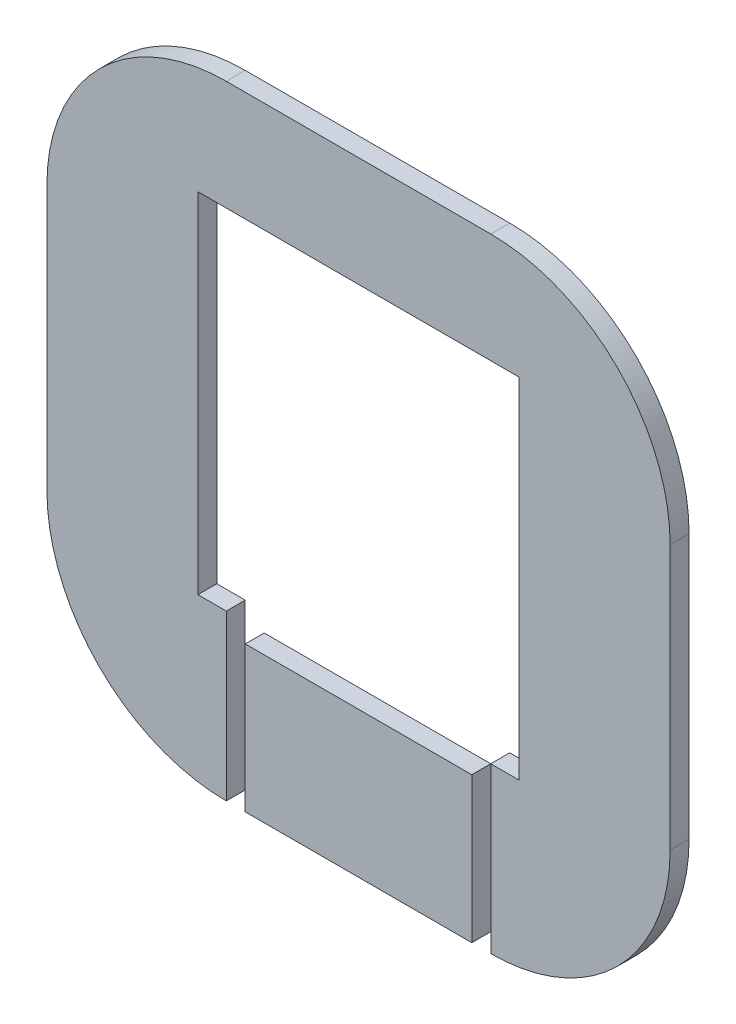
ISO-10303-21;
HEADER;
FILE_DESCRIPTION(('STEP AP214'),'2;1');
FILE_NAME('part.step','',(''),(''),'','','');
FILE_SCHEMA(('AUTOMOTIVE_DESIGN { 1 0 10303 214 1 1 1 1 }'));
ENDSEC;
DATA;
#1=APPLICATION_CONTEXT('core data for automotive mechanical design processes');
#2=APPLICATION_PROTOCOL_DEFINITION('international standard','automotive_design',2000,#1);
#3=PRODUCT_CONTEXT('',#1,'mechanical');
#4=PRODUCT('Part','Part','',(#3));
#5=PRODUCT_RELATED_PRODUCT_CATEGORY('part','',(#4));
#6=PRODUCT_DEFINITION_FORMATION('','',#4);
#7=PRODUCT_DEFINITION_CONTEXT('part definition',#1,'design');
#8=PRODUCT_DEFINITION('design','',#6,#7);
#9=PRODUCT_DEFINITION_SHAPE('','',#8);
#10=(LENGTH_UNIT() NAMED_UNIT(*) SI_UNIT(.MILLI.,.METRE.));
#11=(NAMED_UNIT(*) PLANE_ANGLE_UNIT() SI_UNIT($,.RADIAN.));
#12=(NAMED_UNIT(*) SI_UNIT($,.STERADIAN.) SOLID_ANGLE_UNIT());
#13=UNCERTAINTY_MEASURE_WITH_UNIT(LENGTH_MEASURE(1.E-05),#10,'distance_accuracy_value','');
#14=(GEOMETRIC_REPRESENTATION_CONTEXT(3) GLOBAL_UNCERTAINTY_ASSIGNED_CONTEXT((#13)) GLOBAL_UNIT_ASSIGNED_CONTEXT((#10,
#11,#12)) REPRESENTATION_CONTEXT('',''));
#15=CARTESIAN_POINT('',(0.,0.,0.));
#16=DIRECTION('',(0.,0.,1.));
#17=DIRECTION('',(1.,0.,0.));
#18=AXIS2_PLACEMENT_3D('',#15,#16,#17);
#19=CARTESIAN_POINT('',(30.,-51.5,4.3));
#20=DIRECTION('',(0.,0.,1.));
#21=DIRECTION('',(1.,0.,0.));
#22=AXIS2_PLACEMENT_3D('',#19,#20,#21);
#23=PLANE('',#22);
#24=DIRECTION('',(0.,1.,0.));
#25=VECTOR('',#24,1.);
#26=CARTESIAN_POINT('',(30.,0.,4.3));
#27=LINE('',#26,#25);
#28=CARTESIAN_POINT('',(30.,-92.2,4.3));
#29=VERTEX_POINT('',#28);
#30=CARTESIAN_POINT('',(30.,-54.89,4.3));
#31=VERTEX_POINT('',#30);
#32=EDGE_CURVE('E202',#29,#31,#27,.T.);
#33=ORIENTED_EDGE('',*,*,#32,.F.);
#34=CARTESIAN_POINT('',(30.,-51.5,4.3));
#35=DIRECTION('',(0.,0.,1.));
#36=DIRECTION('',(1.,0.,0.));
#37=AXIS2_PLACEMENT_3D('',#34,#35,#36);
#38=CIRCLE('',#37,40.7);
#39=CARTESIAN_POINT('',(70.7,-51.5,4.3));
#40=VERTEX_POINT('',#39);
#41=EDGE_CURVE('E290',#29,#40,#38,.T.);
#42=ORIENTED_EDGE('',*,*,#41,.T.);
#43=DIRECTION('',(0.,1.,0.));
#44=VECTOR('',#43,1.);
#45=CARTESIAN_POINT('',(70.7,8.50000000000001,4.3));
#46=LINE('',#45,#44);
#47=CARTESIAN_POINT('',(70.7,8.50000000000001,4.3));
#48=VERTEX_POINT('',#47);
#49=EDGE_CURVE('E287',#40,#48,#46,.T.);
#50=ORIENTED_EDGE('',*,*,#49,.T.);
#51=CARTESIAN_POINT('',(30.,8.50000000000001,4.3));
#52=DIRECTION('',(0.,0.,1.));
#53=DIRECTION('',(-1.,0.,0.));
#54=AXIS2_PLACEMENT_3D('',#51,#52,#53);
#55=CIRCLE('',#54,40.7);
#56=CARTESIAN_POINT('',(30.,49.2,4.3));
#57=VERTEX_POINT('',#56);
#58=EDGE_CURVE('E283',#48,#57,#55,.T.);
#59=ORIENTED_EDGE('',*,*,#58,.T.);
#60=DIRECTION('',(-1.,0.,0.));
#61=VECTOR('',#60,1.);
#62=CARTESIAN_POINT('',(-30.,49.2,4.3));
#63=LINE('',#62,#61);
#64=CARTESIAN_POINT('',(-30.,49.2,4.3));
#65=VERTEX_POINT('',#64);
#66=EDGE_CURVE('E279',#57,#65,#63,.T.);
#67=ORIENTED_EDGE('',*,*,#66,.T.);
#68=CARTESIAN_POINT('',(-30.,8.5,4.3));
#69=DIRECTION('',(0.,0.,1.));
#70=DIRECTION('',(-1.,0.,0.));
#71=AXIS2_PLACEMENT_3D('',#68,#69,#70);
#72=CIRCLE('',#71,40.7);
#73=CARTESIAN_POINT('',(-70.7,8.50000000000001,4.3));
#74=VERTEX_POINT('',#73);
#75=EDGE_CURVE('E275',#65,#74,#72,.T.);
#76=ORIENTED_EDGE('',*,*,#75,.T.);
#77=DIRECTION('',(0.,-1.,0.));
#78=VECTOR('',#77,1.);
#79=CARTESIAN_POINT('',(-70.7,8.50000000000001,4.3));
#80=LINE('',#79,#78);
#81=CARTESIAN_POINT('',(-70.7,-51.5,4.3));
#82=VERTEX_POINT('',#81);
#83=EDGE_CURVE('E271',#74,#82,#80,.T.);
#84=ORIENTED_EDGE('',*,*,#83,.T.);
#85=CARTESIAN_POINT('',(-30.,-51.5,4.3));
#86=DIRECTION('',(0.,0.,1.));
#87=DIRECTION('',(1.,0.,0.));
#88=AXIS2_PLACEMENT_3D('',#85,#86,#87);
#89=CIRCLE('',#88,40.7);
#90=CARTESIAN_POINT('',(-30.,-92.2,4.3));
#91=VERTEX_POINT('',#90);
#92=EDGE_CURVE('E214',#82,#91,#89,.T.);
#93=ORIENTED_EDGE('',*,*,#92,.T.);
#94=DIRECTION('',(0.,1.,0.));
#95=VECTOR('',#94,1.);
#96=CARTESIAN_POINT('',(-30.,0.,4.3));
#97=LINE('',#96,#95);
#98=CARTESIAN_POINT('',(-30.,-54.89,4.3));
#99=VERTEX_POINT('',#98);
#100=EDGE_CURVE('E209',#91,#99,#97,.T.);
#101=ORIENTED_EDGE('',*,*,#100,.T.);
#102=DIRECTION('',(1.,0.,0.));
#103=VECTOR('',#102,1.);
#104=CARTESIAN_POINT('',(0.,-54.89,4.3));
#105=LINE('',#104,#103);
#106=CARTESIAN_POINT('',(-36.45,-54.89,4.3));
#107=VERTEX_POINT('',#106);
#108=EDGE_CURVE('E159',#107,#99,#105,.T.);
#109=ORIENTED_EDGE('',*,*,#108,.F.);
#110=DIRECTION('',(0.,-1.,0.));
#111=VECTOR('',#110,1.);
#112=CARTESIAN_POINT('',(-36.45,0.,4.3));
#113=LINE('',#112,#111);
#114=CARTESIAN_POINT('',(-36.45,24.29,4.3));
#115=VERTEX_POINT('',#114);
#116=EDGE_CURVE('E154',#115,#107,#113,.T.);
#117=ORIENTED_EDGE('',*,*,#116,.F.);
#118=DIRECTION('',(1.,0.,0.));
#119=VECTOR('',#118,1.);
#120=CARTESIAN_POINT('',(0.,24.29,4.3));
#121=LINE('',#120,#119);
#122=CARTESIAN_POINT('',(36.45,24.29,4.3));
#123=VERTEX_POINT('',#122);
#124=EDGE_CURVE('E213',#115,#123,#121,.T.);
#125=ORIENTED_EDGE('',*,*,#124,.T.);
#126=DIRECTION('',(0.,-1.,0.));
#127=VECTOR('',#126,1.);
#128=CARTESIAN_POINT('',(36.45,0.,4.3));
#129=LINE('',#128,#127);
#130=CARTESIAN_POINT('',(36.45,-54.89,4.3));
#131=VERTEX_POINT('',#130);
#132=EDGE_CURVE('E220',#123,#131,#129,.T.);
#133=ORIENTED_EDGE('',*,*,#132,.T.);
#134=EDGE_CURVE('E203',#31,#131,#105,.T.);
#135=ORIENTED_EDGE('',*,*,#134,.F.);
#136=EDGE_LOOP('',(#33,#42,#50,#59,#67,#76,#84,#93,#101,#109,#117,#125,#133,#135));
#137=FACE_BOUND('',#136,.T.);
#138=ADVANCED_FACE('F90',(#137),#23,.T.);
#139=CARTESIAN_POINT('',(30.,-51.5,0.));
#140=DIRECTION('',(0.,0.,1.));
#141=DIRECTION('',(1.,0.,0.));
#142=AXIS2_PLACEMENT_3D('',#139,#140,#141);
#143=PLANE('',#142);
#144=CARTESIAN_POINT('',(30.,-51.5,0.));
#145=DIRECTION('',(0.,0.,1.));
#146=DIRECTION('',(1.,0.,0.));
#147=AXIS2_PLACEMENT_3D('',#144,#145,#146);
#148=CIRCLE('',#147,40.7);
#149=CARTESIAN_POINT('',(30.,-92.2,0.));
#150=VERTEX_POINT('',#149);
#151=CARTESIAN_POINT('',(70.7,-51.5,0.));
#152=VERTEX_POINT('',#151);
#153=EDGE_CURVE('E169',#150,#152,#148,.T.);
#154=ORIENTED_EDGE('',*,*,#153,.F.);
#155=DIRECTION('',(0.,1.,0.));
#156=VECTOR('',#155,1.);
#157=CARTESIAN_POINT('',(30.,0.,0.));
#158=LINE('',#157,#156);
#159=CARTESIAN_POINT('',(30.,-54.89,0.));
#160=VERTEX_POINT('',#159);
#161=EDGE_CURVE('E181',#150,#160,#158,.T.);
#162=ORIENTED_EDGE('',*,*,#161,.T.);
#163=DIRECTION('',(1.,0.,0.));
#164=VECTOR('',#163,1.);
#165=CARTESIAN_POINT('',(0.,-54.89,0.));
#166=LINE('',#165,#164);
#167=CARTESIAN_POINT('',(36.45,-54.89,0.));
#168=VERTEX_POINT('',#167);
#169=EDGE_CURVE('E171',#160,#168,#166,.T.);
#170=ORIENTED_EDGE('',*,*,#169,.T.);
#171=DIRECTION('',(0.,-1.,0.));
#172=VECTOR('',#171,1.);
#173=CARTESIAN_POINT('',(36.45,0.,0.));
#174=LINE('',#173,#172);
#175=CARTESIAN_POINT('',(36.45,24.29,0.));
#176=VERTEX_POINT('',#175);
#177=EDGE_CURVE('E93',#176,#168,#174,.T.);
#178=ORIENTED_EDGE('',*,*,#177,.F.);
#179=DIRECTION('',(1.,0.,0.));
#180=VECTOR('',#179,1.);
#181=CARTESIAN_POINT('',(0.,24.29,0.));
#182=LINE('',#181,#180);
#183=CARTESIAN_POINT('',(-36.45,24.29,0.));
#184=VERTEX_POINT('',#183);
#185=EDGE_CURVE('E176',#184,#176,#182,.T.);
#186=ORIENTED_EDGE('',*,*,#185,.F.);
#187=DIRECTION('',(0.,-1.,0.));
#188=VECTOR('',#187,1.);
#189=CARTESIAN_POINT('',(-36.45,0.,0.));
#190=LINE('',#189,#188);
#191=CARTESIAN_POINT('',(-36.45,-54.89,0.));
#192=VERTEX_POINT('',#191);
#193=EDGE_CURVE('E151',#184,#192,#190,.T.);
#194=ORIENTED_EDGE('',*,*,#193,.T.);
#195=CARTESIAN_POINT('',(-30.,-54.89,0.));
#196=VERTEX_POINT('',#195);
#197=EDGE_CURVE('E163',#192,#196,#166,.T.);
#198=ORIENTED_EDGE('',*,*,#197,.T.);
#199=DIRECTION('',(0.,1.,0.));
#200=VECTOR('',#199,1.);
#201=CARTESIAN_POINT('',(-30.,0.,0.));
#202=LINE('',#201,#200);
#203=CARTESIAN_POINT('',(-30.,-92.2,0.));
#204=VERTEX_POINT('',#203);
#205=EDGE_CURVE('E199',#204,#196,#202,.T.);
#206=ORIENTED_EDGE('',*,*,#205,.F.);
#207=CARTESIAN_POINT('',(-30.,-51.5,0.));
#208=DIRECTION('',(0.,0.,1.));
#209=DIRECTION('',(1.,0.,0.));
#210=AXIS2_PLACEMENT_3D('',#207,#208,#209);
#211=CIRCLE('',#210,40.7);
#212=CARTESIAN_POINT('',(-70.7,-51.5,0.));
#213=VERTEX_POINT('',#212);
#214=EDGE_CURVE('E235',#213,#204,#211,.T.);
#215=ORIENTED_EDGE('',*,*,#214,.F.);
#216=DIRECTION('',(0.,-1.,0.));
#217=VECTOR('',#216,1.);
#218=CARTESIAN_POINT('',(-70.7,8.50000000000001,0.));
#219=LINE('',#218,#217);
#220=CARTESIAN_POINT('',(-70.7,8.50000000000001,0.));
#221=VERTEX_POINT('',#220);
#222=EDGE_CURVE('E240',#221,#213,#219,.T.);
#223=ORIENTED_EDGE('',*,*,#222,.F.);
#224=CARTESIAN_POINT('',(-30.,8.5,0.));
#225=DIRECTION('',(0.,0.,1.));
#226=DIRECTION('',(-1.,0.,0.));
#227=AXIS2_PLACEMENT_3D('',#224,#225,#226);
#228=CIRCLE('',#227,40.7);
#229=CARTESIAN_POINT('',(-30.,49.2,0.));
#230=VERTEX_POINT('',#229);
#231=EDGE_CURVE('E245',#230,#221,#228,.T.);
#232=ORIENTED_EDGE('',*,*,#231,.F.);
#233=DIRECTION('',(-1.,0.,0.));
#234=VECTOR('',#233,1.);
#235=CARTESIAN_POINT('',(-30.,49.2,0.));
#236=LINE('',#235,#234);
#237=CARTESIAN_POINT('',(30.,49.2,0.));
#238=VERTEX_POINT('',#237);
#239=EDGE_CURVE('E250',#238,#230,#236,.T.);
#240=ORIENTED_EDGE('',*,*,#239,.F.);
#241=CARTESIAN_POINT('',(30.,8.50000000000001,0.));
#242=DIRECTION('',(0.,0.,1.));
#243=DIRECTION('',(-1.,0.,0.));
#244=AXIS2_PLACEMENT_3D('',#241,#242,#243);
#245=CIRCLE('',#244,40.7);
#246=CARTESIAN_POINT('',(70.7,8.50000000000001,0.));
#247=VERTEX_POINT('',#246);
#248=EDGE_CURVE('E255',#247,#238,#245,.T.);
#249=ORIENTED_EDGE('',*,*,#248,.F.);
#250=DIRECTION('',(0.,1.,0.));
#251=VECTOR('',#250,1.);
#252=CARTESIAN_POINT('',(70.7,8.50000000000001,0.));
#253=LINE('',#252,#251);
#254=EDGE_CURVE('E260',#152,#247,#253,.T.);
#255=ORIENTED_EDGE('',*,*,#254,.F.);
#256=EDGE_LOOP('',(#154,#162,#170,#178,#186,#194,#198,#206,#215,#223,#232,#240,#249,#255));
#257=FACE_BOUND('',#256,.T.);
#258=ADVANCED_FACE('F173',(#257),#143,.F.);
#259=CARTESIAN_POINT('',(30.,-51.5,4.3));
#260=DIRECTION('',(0.,0.,-1.));
#261=DIRECTION('',(-1.,0.,0.));
#262=AXIS2_PLACEMENT_3D('',#259,#260,#261);
#263=CYLINDRICAL_SURFACE('',#262,40.7);
#264=ORIENTED_EDGE('',*,*,#153,.T.);
#265=DIRECTION('',(0.,0.,-1.));
#266=VECTOR('',#265,1.);
#267=CARTESIAN_POINT('',(70.7,-51.5,4.3));
#268=LINE('',#267,#266);
#269=EDGE_CURVE('E259',#40,#152,#268,.T.);
#270=ORIENTED_EDGE('',*,*,#269,.F.);
#271=ORIENTED_EDGE('',*,*,#41,.F.);
#272=DIRECTION('',(0.,0.,-1.));
#273=VECTOR('',#272,1.);
#274=CARTESIAN_POINT('',(30.,-92.2,4.3));
#275=LINE('',#274,#273);
#276=EDGE_CURVE('E264',#29,#150,#275,.T.);
#277=ORIENTED_EDGE('',*,*,#276,.T.);
#278=EDGE_LOOP('',(#264,#270,#271,#277));
#279=FACE_BOUND('',#278,.T.);
#280=ADVANCED_FACE('F306',(#279),#263,.T.);
#281=CARTESIAN_POINT('',(70.7,8.50000000000001,4.3));
#282=DIRECTION('',(-1.,0.,0.));
#283=DIRECTION('',(0.,-1.,0.));
#284=AXIS2_PLACEMENT_3D('',#281,#282,#283);
#285=PLANE('',#284);
#286=ORIENTED_EDGE('',*,*,#254,.T.);
#287=DIRECTION('',(0.,0.,-1.));
#288=VECTOR('',#287,1.);
#289=CARTESIAN_POINT('',(70.7,8.50000000000001,4.3));
#290=LINE('',#289,#288);
#291=EDGE_CURVE('E254',#48,#247,#290,.T.);
#292=ORIENTED_EDGE('',*,*,#291,.F.);
#293=ORIENTED_EDGE('',*,*,#49,.F.);
#294=ORIENTED_EDGE('',*,*,#269,.T.);
#295=EDGE_LOOP('',(#286,#292,#293,#294));
#296=FACE_BOUND('',#295,.T.);
#297=ADVANCED_FACE('F312',(#296),#285,.F.);
#298=CARTESIAN_POINT('',(30.,8.50000000000001,4.3));
#299=DIRECTION('',(0.,0.,-1.));
#300=DIRECTION('',(-1.,0.,0.));
#301=AXIS2_PLACEMENT_3D('',#298,#299,#300);
#302=CYLINDRICAL_SURFACE('',#301,40.7);
#303=ORIENTED_EDGE('',*,*,#248,.T.);
#304=DIRECTION('',(0.,0.,-1.));
#305=VECTOR('',#304,1.);
#306=CARTESIAN_POINT('',(30.,49.2,4.3));
#307=LINE('',#306,#305);
#308=EDGE_CURVE('E249',#57,#238,#307,.T.);
#309=ORIENTED_EDGE('',*,*,#308,.F.);
#310=ORIENTED_EDGE('',*,*,#58,.F.);
#311=ORIENTED_EDGE('',*,*,#291,.T.);
#312=EDGE_LOOP('',(#303,#309,#310,#311));
#313=FACE_BOUND('',#312,.T.);
#314=ADVANCED_FACE('F323',(#313),#302,.T.);
#315=CARTESIAN_POINT('',(-30.,49.2,4.3));
#316=DIRECTION('',(0.,-1.,0.));
#317=DIRECTION('',(1.,0.,0.));
#318=AXIS2_PLACEMENT_3D('',#315,#316,#317);
#319=PLANE('',#318);
#320=ORIENTED_EDGE('',*,*,#239,.T.);
#321=DIRECTION('',(0.,0.,-1.));
#322=VECTOR('',#321,1.);
#323=CARTESIAN_POINT('',(-30.,49.2,4.3));
#324=LINE('',#323,#322);
#325=EDGE_CURVE('E244',#65,#230,#324,.T.);
#326=ORIENTED_EDGE('',*,*,#325,.F.);
#327=ORIENTED_EDGE('',*,*,#66,.F.);
#328=ORIENTED_EDGE('',*,*,#308,.T.);
#329=EDGE_LOOP('',(#320,#326,#327,#328));
#330=FACE_BOUND('',#329,.T.);
#331=ADVANCED_FACE('F408',(#330),#319,.F.);
#332=CARTESIAN_POINT('',(-30.,8.5,4.3));
#333=DIRECTION('',(0.,0.,-1.));
#334=DIRECTION('',(-1.,0.,0.));
#335=AXIS2_PLACEMENT_3D('',#332,#333,#334);
#336=CYLINDRICAL_SURFACE('',#335,40.7);
#337=ORIENTED_EDGE('',*,*,#231,.T.);
#338=DIRECTION('',(0.,0.,-1.));
#339=VECTOR('',#338,1.);
#340=CARTESIAN_POINT('',(-70.7,8.50000000000001,4.3));
#341=LINE('',#340,#339);
#342=EDGE_CURVE('E239',#74,#221,#341,.T.);
#343=ORIENTED_EDGE('',*,*,#342,.F.);
#344=ORIENTED_EDGE('',*,*,#75,.F.);
#345=ORIENTED_EDGE('',*,*,#325,.T.);
#346=EDGE_LOOP('',(#337,#343,#344,#345));
#347=FACE_BOUND('',#346,.T.);
#348=ADVANCED_FACE('F353',(#347),#336,.T.);
#349=CARTESIAN_POINT('',(-70.7,8.50000000000001,4.3));
#350=DIRECTION('',(1.,0.,0.));
#351=DIRECTION('',(0.,0.,-1.));
#352=AXIS2_PLACEMENT_3D('',#349,#350,#351);
#353=PLANE('',#352);
#354=ORIENTED_EDGE('',*,*,#222,.T.);
#355=DIRECTION('',(0.,0.,-1.));
#356=VECTOR('',#355,1.);
#357=CARTESIAN_POINT('',(-70.7,-51.5,4.3));
#358=LINE('',#357,#356);
#359=EDGE_CURVE('E233',#82,#213,#358,.T.);
#360=ORIENTED_EDGE('',*,*,#359,.F.);
#361=ORIENTED_EDGE('',*,*,#83,.F.);
#362=ORIENTED_EDGE('',*,*,#342,.T.);
#363=EDGE_LOOP('',(#354,#360,#361,#362));
#364=FACE_BOUND('',#363,.T.);
#365=ADVANCED_FACE('F359',(#364),#353,.F.);
#366=CARTESIAN_POINT('',(-30.,-51.5,4.3));
#367=DIRECTION('',(0.,0.,-1.));
#368=DIRECTION('',(-1.,0.,0.));
#369=AXIS2_PLACEMENT_3D('',#366,#367,#368);
#370=CYLINDRICAL_SURFACE('',#369,40.7);
#371=ORIENTED_EDGE('',*,*,#214,.T.);
#372=DIRECTION('',(0.,0.,-1.));
#373=VECTOR('',#372,1.);
#374=CARTESIAN_POINT('',(-30.,-92.2,4.3));
#375=LINE('',#374,#373);
#376=EDGE_CURVE('E208',#91,#204,#375,.T.);
#377=ORIENTED_EDGE('',*,*,#376,.F.);
#378=ORIENTED_EDGE('',*,*,#92,.F.);
#379=ORIENTED_EDGE('',*,*,#359,.T.);
#380=EDGE_LOOP('',(#371,#377,#378,#379));
#381=FACE_BOUND('',#380,.T.);
#382=ADVANCED_FACE('F365',(#381),#370,.T.);
#383=CARTESIAN_POINT('',(0.,-54.89,0.));
#384=DIRECTION('',(0.,-1.,0.));
#385=DIRECTION('',(0.,0.,-1.));
#386=AXIS2_PLACEMENT_3D('',#383,#384,#385);
#387=PLANE('',#386);
#388=ORIENTED_EDGE('',*,*,#134,.T.);
#389=DIRECTION('',(0.,0.,1.));
#390=VECTOR('',#389,1.);
#391=CARTESIAN_POINT('',(36.45,-54.89,0.));
#392=LINE('',#391,#390);
#393=EDGE_CURVE('E13',#168,#131,#392,.T.);
#394=ORIENTED_EDGE('',*,*,#393,.F.);
#395=ORIENTED_EDGE('',*,*,#169,.F.);
#396=DIRECTION('',(0.,0.,1.));
#397=VECTOR('',#396,1.);
#398=CARTESIAN_POINT('',(30.,-54.89,0.));
#399=LINE('',#398,#397);
#400=EDGE_CURVE('E200',#160,#31,#399,.T.);
#401=ORIENTED_EDGE('',*,*,#400,.T.);
#402=EDGE_LOOP('',(#388,#394,#395,#401));
#403=FACE_BOUND('',#402,.T.);
#404=ADVANCED_FACE('F374',(#403),#387,.F.);
#405=CARTESIAN_POINT('',(30.,0.,0.));
#406=DIRECTION('',(1.,0.,0.));
#407=DIRECTION('',(0.,0.,-1.));
#408=AXIS2_PLACEMENT_3D('',#405,#406,#407);
#409=PLANE('',#408);
#410=ORIENTED_EDGE('',*,*,#32,.T.);
#411=ORIENTED_EDGE('',*,*,#400,.F.);
#412=ORIENTED_EDGE('',*,*,#161,.F.);
#413=ORIENTED_EDGE('',*,*,#276,.F.);
#414=EDGE_LOOP('',(#410,#411,#412,#413));
#415=FACE_BOUND('',#414,.T.);
#416=ADVANCED_FACE('F335',(#415),#409,.F.);
#417=CARTESIAN_POINT('',(-30.,0.,0.));
#418=DIRECTION('',(1.,0.,0.));
#419=DIRECTION('',(0.,0.,-1.));
#420=AXIS2_PLACEMENT_3D('',#417,#418,#419);
#421=PLANE('',#420);
#422=ORIENTED_EDGE('',*,*,#100,.F.);
#423=ORIENTED_EDGE('',*,*,#376,.T.);
#424=ORIENTED_EDGE('',*,*,#205,.T.);
#425=DIRECTION('',(0.,0.,1.));
#426=VECTOR('',#425,1.);
#427=CARTESIAN_POINT('',(-30.,-54.89,0.));
#428=LINE('',#427,#426);
#429=EDGE_CURVE('E165',#196,#99,#428,.T.);
#430=ORIENTED_EDGE('',*,*,#429,.T.);
#431=EDGE_LOOP('',(#422,#423,#424,#430));
#432=FACE_BOUND('',#431,.T.);
#433=ADVANCED_FACE('F366',(#432),#421,.T.);
#434=ORIENTED_EDGE('',*,*,#108,.T.);
#435=ORIENTED_EDGE('',*,*,#429,.F.);
#436=ORIENTED_EDGE('',*,*,#197,.F.);
#437=DIRECTION('',(0.,0.,1.));
#438=VECTOR('',#437,1.);
#439=CARTESIAN_POINT('',(-36.45,-54.89,0.));
#440=LINE('',#439,#438);
#441=EDGE_CURVE('E147',#192,#107,#440,.T.);
#442=ORIENTED_EDGE('',*,*,#441,.T.);
#443=EDGE_LOOP('',(#434,#435,#436,#442));
#444=FACE_BOUND('',#443,.T.);
#445=ADVANCED_FACE('F164',(#444),#387,.F.);
#446=CARTESIAN_POINT('',(-36.45,0.,0.));
#447=DIRECTION('',(-1.,0.,0.));
#448=DIRECTION('',(0.,-1.,0.));
#449=AXIS2_PLACEMENT_3D('',#446,#447,#448);
#450=PLANE('',#449);
#451=ORIENTED_EDGE('',*,*,#116,.T.);
#452=ORIENTED_EDGE('',*,*,#441,.F.);
#453=ORIENTED_EDGE('',*,*,#193,.F.);
#454=DIRECTION('',(0.,0.,1.));
#455=VECTOR('',#454,1.);
#456=CARTESIAN_POINT('',(-36.45,24.29,0.));
#457=LINE('',#456,#455);
#458=EDGE_CURVE('E185',#184,#115,#457,.T.);
#459=ORIENTED_EDGE('',*,*,#458,.T.);
#460=EDGE_LOOP('',(#451,#452,#453,#459));
#461=FACE_BOUND('',#460,.T.);
#462=ADVANCED_FACE('F149',(#461),#450,.F.);
#463=CARTESIAN_POINT('',(0.,24.29,0.));
#464=DIRECTION('',(0.,-1.,0.));
#465=DIRECTION('',(0.,0.,-1.));
#466=AXIS2_PLACEMENT_3D('',#463,#464,#465);
#467=PLANE('',#466);
#468=ORIENTED_EDGE('',*,*,#124,.F.);
#469=ORIENTED_EDGE('',*,*,#458,.F.);
#470=ORIENTED_EDGE('',*,*,#185,.T.);
#471=DIRECTION('',(0.,0.,1.));
#472=VECTOR('',#471,1.);
#473=CARTESIAN_POINT('',(36.45,24.29,0.));
#474=LINE('',#473,#472);
#475=EDGE_CURVE('E184',#176,#123,#474,.T.);
#476=ORIENTED_EDGE('',*,*,#475,.T.);
#477=EDGE_LOOP('',(#468,#469,#470,#476));
#478=FACE_BOUND('',#477,.T.);
#479=ADVANCED_FACE('F395',(#478),#467,.T.);
#480=CARTESIAN_POINT('',(36.45,0.,0.));
#481=DIRECTION('',(-1.,0.,0.));
#482=DIRECTION('',(0.,-1.,0.));
#483=AXIS2_PLACEMENT_3D('',#480,#481,#482);
#484=PLANE('',#483);
#485=ORIENTED_EDGE('',*,*,#132,.F.);
#486=ORIENTED_EDGE('',*,*,#475,.F.);
#487=ORIENTED_EDGE('',*,*,#177,.T.);
#488=ORIENTED_EDGE('',*,*,#393,.T.);
#489=EDGE_LOOP('',(#485,#486,#487,#488));
#490=FACE_BOUND('',#489,.T.);
#491=ADVANCED_FACE('F393',(#490),#484,.T.);
#492=CLOSED_SHELL('',(#138,#258,#280,#297,#314,#331,#348,#365,#382,#404,#416,#433,#445,#462,
#479,#491));
#493=MANIFOLD_SOLID_BREP('B2',#492);
#494=CARTESIAN_POINT('',(30.,-51.5,0.));
#495=DIRECTION('',(0.,0.,1.));
#496=DIRECTION('',(1.,0.,0.));
#497=AXIS2_PLACEMENT_3D('',#494,#495,#496);
#498=PLANE('',#497);
#499=DIRECTION('',(1.,0.,0.));
#500=VECTOR('',#499,1.);
#501=CARTESIAN_POINT('',(0.500000000000032,-92.2,0.));
#502=LINE('',#501,#500);
#503=CARTESIAN_POINT('',(-25.7,-92.2,0.));
#504=VERTEX_POINT('',#503);
#505=CARTESIAN_POINT('',(25.7,-92.2,0.));
#506=VERTEX_POINT('',#505);
#507=EDGE_CURVE('E528',#504,#506,#502,.T.);
#508=ORIENTED_EDGE('',*,*,#507,.F.);
#509=DIRECTION('',(0.,1.,0.));
#510=VECTOR('',#509,1.);
#511=CARTESIAN_POINT('',(-25.7,0.,0.));
#512=LINE('',#511,#510);
#513=CARTESIAN_POINT('',(-25.7,-59.19,0.));
#514=VERTEX_POINT('',#513);
#515=EDGE_CURVE('E571',#504,#514,#512,.T.);
#516=ORIENTED_EDGE('',*,*,#515,.T.);
#517=DIRECTION('',(1.,0.,0.));
#518=VECTOR('',#517,1.);
#519=CARTESIAN_POINT('',(0.,-59.19,0.));
#520=LINE('',#519,#518);
#521=CARTESIAN_POINT('',(25.7,-59.19,0.));
#522=VERTEX_POINT('',#521);
#523=EDGE_CURVE('E577',#514,#522,#520,.T.);
#524=ORIENTED_EDGE('',*,*,#523,.T.);
#525=DIRECTION('',(0.,-1.,0.));
#526=VECTOR('',#525,1.);
#527=CARTESIAN_POINT('',(25.7,-59.19,0.));
#528=LINE('',#527,#526);
#529=EDGE_CURVE('E584',#522,#506,#528,.T.);
#530=ORIENTED_EDGE('',*,*,#529,.T.);
#531=EDGE_LOOP('',(#508,#516,#524,#530));
#532=FACE_BOUND('',#531,.T.);
#533=ADVANCED_FACE('F524',(#532),#498,.F.);
#534=CARTESIAN_POINT('',(30.,-51.5,4.3));
#535=DIRECTION('',(0.,0.,1.));
#536=DIRECTION('',(1.,0.,0.));
#537=AXIS2_PLACEMENT_3D('',#534,#535,#536);
#538=PLANE('',#537);
#539=DIRECTION('',(0.,1.,0.));
#540=VECTOR('',#539,1.);
#541=CARTESIAN_POINT('',(-25.7,0.,4.3));
#542=LINE('',#541,#540);
#543=CARTESIAN_POINT('',(-25.7,-92.2,4.3));
#544=VERTEX_POINT('',#543);
#545=CARTESIAN_POINT('',(-25.7,-59.19,4.3));
#546=VERTEX_POINT('',#545);
#547=EDGE_CURVE('E590',#544,#546,#542,.T.);
#548=ORIENTED_EDGE('',*,*,#547,.F.);
#549=DIRECTION('',(1.,0.,0.));
#550=VECTOR('',#549,1.);
#551=CARTESIAN_POINT('',(-30.,-92.2,4.3));
#552=LINE('',#551,#550);
#553=CARTESIAN_POINT('',(25.7,-92.2,4.3));
#554=VERTEX_POINT('',#553);
#555=EDGE_CURVE('E88',#544,#554,#552,.T.);
#556=ORIENTED_EDGE('',*,*,#555,.T.);
#557=DIRECTION('',(0.,-1.,0.));
#558=VECTOR('',#557,1.);
#559=CARTESIAN_POINT('',(25.7,-59.19,4.3));
#560=LINE('',#559,#558);
#561=CARTESIAN_POINT('',(25.7,-59.19,4.3));
#562=VERTEX_POINT('',#561);
#563=EDGE_CURVE('E555',#562,#554,#560,.T.);
#564=ORIENTED_EDGE('',*,*,#563,.F.);
#565=DIRECTION('',(1.,0.,0.));
#566=VECTOR('',#565,1.);
#567=CARTESIAN_POINT('',(0.,-59.19,4.3));
#568=LINE('',#567,#566);
#569=EDGE_CURVE('E578',#546,#562,#568,.T.);
#570=ORIENTED_EDGE('',*,*,#569,.F.);
#571=EDGE_LOOP('',(#548,#556,#564,#570));
#572=FACE_BOUND('',#571,.T.);
#573=ADVANCED_FACE('F597',(#572),#538,.T.);
#574=CARTESIAN_POINT('',(0.500000000000032,-92.2,4.3));
#575=DIRECTION('',(0.,1.,0.));
#576=DIRECTION('',(0.,0.,1.));
#577=AXIS2_PLACEMENT_3D('',#574,#575,#576);
#578=PLANE('',#577);
#579=ORIENTED_EDGE('',*,*,#555,.F.);
#580=DIRECTION('',(0.,0.,1.));
#581=VECTOR('',#580,1.);
#582=CARTESIAN_POINT('',(-25.7,-92.2,0.));
#583=LINE('',#582,#581);
#584=EDGE_CURVE('E563',#504,#544,#583,.T.);
#585=ORIENTED_EDGE('',*,*,#584,.F.);
#586=ORIENTED_EDGE('',*,*,#507,.T.);
#587=DIRECTION('',(0.,0.,1.));
#588=VECTOR('',#587,1.);
#589=CARTESIAN_POINT('',(25.7,-92.2,0.));
#590=LINE('',#589,#588);
#591=EDGE_CURVE('E539',#506,#554,#590,.T.);
#592=ORIENTED_EDGE('',*,*,#591,.T.);
#593=EDGE_LOOP('',(#579,#585,#586,#592));
#594=FACE_BOUND('',#593,.T.);
#595=ADVANCED_FACE('F526',(#594),#578,.F.);
#596=CARTESIAN_POINT('',(-25.7,0.,0.));
#597=DIRECTION('',(1.,0.,0.));
#598=DIRECTION('',(0.,0.,-1.));
#599=AXIS2_PLACEMENT_3D('',#596,#597,#598);
#600=PLANE('',#599);
#601=ORIENTED_EDGE('',*,*,#547,.T.);
#602=DIRECTION('',(0.,0.,1.));
#603=VECTOR('',#602,1.);
#604=CARTESIAN_POINT('',(-25.7,-59.19,0.));
#605=LINE('',#604,#603);
#606=EDGE_CURVE('E573',#514,#546,#605,.T.);
#607=ORIENTED_EDGE('',*,*,#606,.F.);
#608=ORIENTED_EDGE('',*,*,#515,.F.);
#609=ORIENTED_EDGE('',*,*,#584,.T.);
#610=EDGE_LOOP('',(#601,#607,#608,#609));
#611=FACE_BOUND('',#610,.T.);
#612=ADVANCED_FACE('F572',(#611),#600,.F.);
#613=CARTESIAN_POINT('',(25.7,-59.19,0.));
#614=DIRECTION('',(-1.,0.,0.));
#615=DIRECTION('',(0.,-1.,0.));
#616=AXIS2_PLACEMENT_3D('',#613,#614,#615);
#617=PLANE('',#616);
#618=ORIENTED_EDGE('',*,*,#563,.T.);
#619=ORIENTED_EDGE('',*,*,#591,.F.);
#620=ORIENTED_EDGE('',*,*,#529,.F.);
#621=DIRECTION('',(0.,0.,-1.));
#622=VECTOR('',#621,1.);
#623=CARTESIAN_POINT('',(25.7,-59.19,0.));
#624=LINE('',#623,#622);
#625=EDGE_CURVE('E548',#562,#522,#624,.T.);
#626=ORIENTED_EDGE('',*,*,#625,.F.);
#627=EDGE_LOOP('',(#618,#619,#620,#626));
#628=FACE_BOUND('',#627,.T.);
#629=ADVANCED_FACE('F605',(#628),#617,.F.);
#630=CARTESIAN_POINT('',(0.,-59.19,0.));
#631=DIRECTION('',(0.,-1.,0.));
#632=DIRECTION('',(0.,0.,-1.));
#633=AXIS2_PLACEMENT_3D('',#630,#631,#632);
#634=PLANE('',#633);
#635=ORIENTED_EDGE('',*,*,#625,.T.);
#636=ORIENTED_EDGE('',*,*,#523,.F.);
#637=ORIENTED_EDGE('',*,*,#606,.T.);
#638=ORIENTED_EDGE('',*,*,#569,.T.);
#639=EDGE_LOOP('',(#635,#636,#637,#638));
#640=FACE_BOUND('',#639,.T.);
#641=ADVANCED_FACE('F595',(#640),#634,.F.);
#642=CLOSED_SHELL('',(#533,#573,#595,#612,#629,#641));
#643=MANIFOLD_SOLID_BREP('B7',#642);
#644=ADVANCED_BREP_SHAPE_REPRESENTATION('',(#18,#493,#643),#14);
#645=SHAPE_DEFINITION_REPRESENTATION(#9,#644);
ENDSEC;
END-ISO-10303-21;
